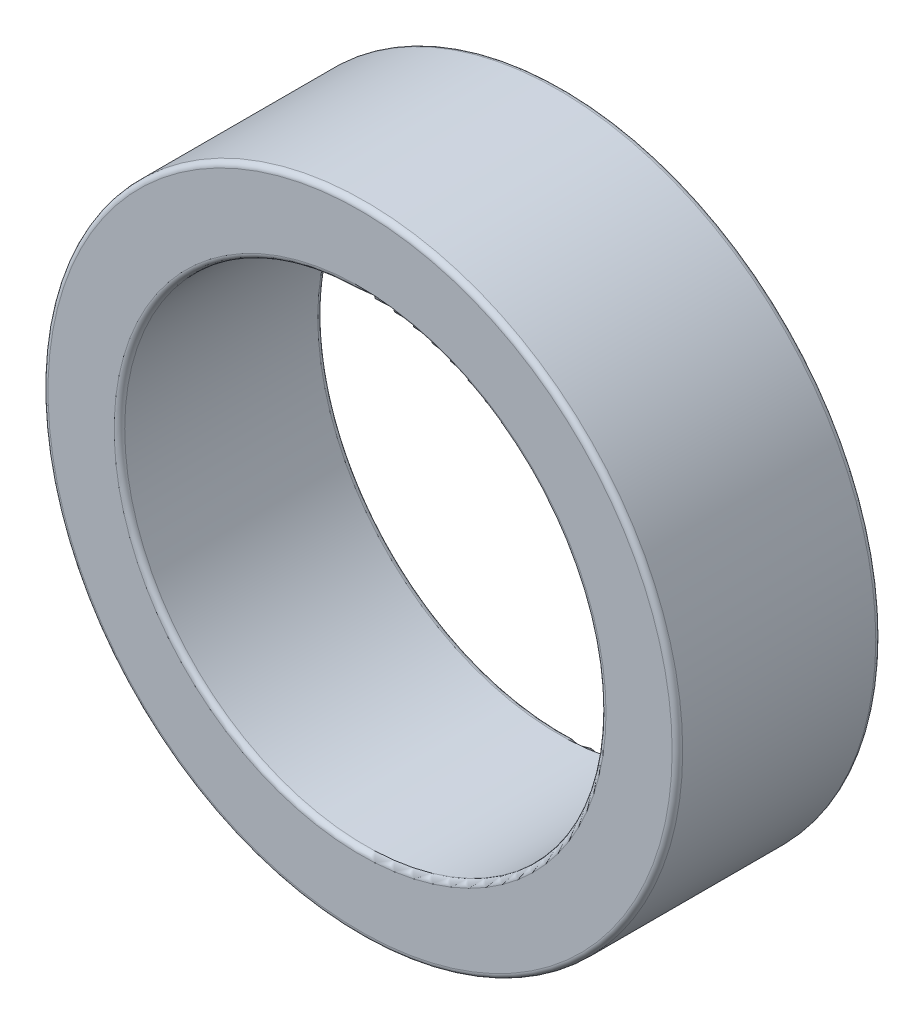
ISO-10303-21;
HEADER;
FILE_DESCRIPTION(('STEP AP214'),'2;1');
FILE_NAME('part.step','',(''),(''),'','','');
FILE_SCHEMA(('AUTOMOTIVE_DESIGN { 1 0 10303 214 1 1 1 1 }'));
ENDSEC;
DATA;
#1=APPLICATION_CONTEXT('core data for automotive mechanical design processes');
#2=APPLICATION_PROTOCOL_DEFINITION('international standard','automotive_design',2000,#1);
#3=PRODUCT_CONTEXT('',#1,'mechanical');
#4=PRODUCT('Part','Part','',(#3));
#5=PRODUCT_RELATED_PRODUCT_CATEGORY('part','',(#4));
#6=PRODUCT_DEFINITION_FORMATION('','',#4);
#7=PRODUCT_DEFINITION_CONTEXT('part definition',#1,'design');
#8=PRODUCT_DEFINITION('design','',#6,#7);
#9=PRODUCT_DEFINITION_SHAPE('','',#8);
#10=(LENGTH_UNIT() NAMED_UNIT(*) SI_UNIT(.MILLI.,.METRE.));
#11=(NAMED_UNIT(*) PLANE_ANGLE_UNIT() SI_UNIT($,.RADIAN.));
#12=(NAMED_UNIT(*) SI_UNIT($,.STERADIAN.) SOLID_ANGLE_UNIT());
#13=UNCERTAINTY_MEASURE_WITH_UNIT(LENGTH_MEASURE(1.E-05),#10,'distance_accuracy_value','');
#14=(GEOMETRIC_REPRESENTATION_CONTEXT(3) GLOBAL_UNCERTAINTY_ASSIGNED_CONTEXT((#13)) GLOBAL_UNIT_ASSIGNED_CONTEXT((#10,
#11,#12)) REPRESENTATION_CONTEXT('',''));
#15=CARTESIAN_POINT('',(0.,0.,0.));
#16=DIRECTION('',(0.,0.,1.));
#17=DIRECTION('',(1.,0.,0.));
#18=AXIS2_PLACEMENT_3D('',#15,#16,#17);
#19=CARTESIAN_POINT('',(0.,0.,3.85));
#20=DIRECTION('',(0.,0.,1.));
#21=DIRECTION('',(1.,0.,0.));
#22=AXIS2_PLACEMENT_3D('',#19,#20,#21);
#23=PLANE('',#22);
#24=CARTESIAN_POINT('',(0.,0.,3.85));
#25=DIRECTION('',(0.,0.,1.));
#26=DIRECTION('',(1.,0.,0.));
#27=AXIS2_PLACEMENT_3D('',#24,#25,#26);
#28=CIRCLE('',#27,4.65);
#29=CARTESIAN_POINT('',(4.65,0.,3.85));
#30=VERTEX_POINT('',#29);
#31=EDGE_CURVE('E10',#30,#30,#28,.F.);
#32=ORIENTED_EDGE('',*,*,#31,.T.);
#33=EDGE_LOOP('',(#32));
#34=FACE_BOUND('',#33,.T.);
#35=CARTESIAN_POINT('',(0.,0.,3.85));
#36=DIRECTION('',(0.,0.,1.));
#37=DIRECTION('',(1.,0.,0.));
#38=AXIS2_PLACEMENT_3D('',#35,#36,#37);
#39=CIRCLE('',#38,5.9);
#40=CARTESIAN_POINT('',(5.9,0.,3.85));
#41=VERTEX_POINT('',#40);
#42=EDGE_CURVE('E39',#41,#41,#39,.T.);
#43=ORIENTED_EDGE('',*,*,#42,.T.);
#44=EDGE_LOOP('',(#43));
#45=FACE_BOUND('',#44,.T.);
#46=ADVANCED_FACE('F32',(#34,#45),#23,.T.);
#47=CARTESIAN_POINT('',(0.,0.,0.));
#48=DIRECTION('',(0.,0.,1.));
#49=DIRECTION('',(1.,0.,0.));
#50=AXIS2_PLACEMENT_3D('',#47,#48,#49);
#51=PLANE('',#50);
#52=CARTESIAN_POINT('',(0.,0.,0.));
#53=DIRECTION('',(0.,0.,1.));
#54=DIRECTION('',(1.,0.,0.));
#55=AXIS2_PLACEMENT_3D('',#52,#53,#54);
#56=CIRCLE('',#55,4.65);
#57=CARTESIAN_POINT('',(4.65,0.,0.));
#58=VERTEX_POINT('',#57);
#59=EDGE_CURVE('E58',#58,#58,#56,.T.);
#60=ORIENTED_EDGE('',*,*,#59,.T.);
#61=EDGE_LOOP('',(#60));
#62=FACE_BOUND('',#61,.T.);
#63=CARTESIAN_POINT('',(0.,0.,0.));
#64=DIRECTION('',(0.,0.,1.));
#65=DIRECTION('',(1.,0.,0.));
#66=AXIS2_PLACEMENT_3D('',#63,#64,#65);
#67=CIRCLE('',#66,5.9);
#68=CARTESIAN_POINT('',(5.9,0.,0.));
#69=VERTEX_POINT('',#68);
#70=EDGE_CURVE('E61',#69,#69,#67,.F.);
#71=ORIENTED_EDGE('',*,*,#70,.T.);
#72=EDGE_LOOP('',(#71));
#73=FACE_BOUND('',#72,.T.);
#74=ADVANCED_FACE('F65',(#62,#73),#51,.F.);
#75=CARTESIAN_POINT('',(0.,0.,3.85));
#76=DIRECTION('',(0.,0.,-1.));
#77=DIRECTION('',(-1.,0.,0.));
#78=AXIS2_PLACEMENT_3D('',#75,#76,#77);
#79=CYLINDRICAL_SURFACE('',#78,6.);
#80=CARTESIAN_POINT('',(0.,0.,0.0999999999999998));
#81=DIRECTION('',(0.,0.,1.));
#82=DIRECTION('',(1.,0.,0.));
#83=AXIS2_PLACEMENT_3D('',#80,#81,#82);
#84=CIRCLE('',#83,6.);
#85=CARTESIAN_POINT('',(6.,0.,0.0999999999999998));
#86=VERTEX_POINT('',#85);
#87=EDGE_CURVE('E43',#86,#86,#84,.T.);
#88=ORIENTED_EDGE('',*,*,#87,.T.);
#89=EDGE_LOOP('',(#88));
#90=FACE_BOUND('',#89,.T.);
#91=CARTESIAN_POINT('',(0.,0.,3.75));
#92=DIRECTION('',(0.,0.,1.));
#93=DIRECTION('',(1.,0.,0.));
#94=AXIS2_PLACEMENT_3D('',#91,#92,#93);
#95=CIRCLE('',#94,6.);
#96=CARTESIAN_POINT('',(6.,0.,3.75));
#97=VERTEX_POINT('',#96);
#98=EDGE_CURVE('E47',#97,#97,#95,.F.);
#99=ORIENTED_EDGE('',*,*,#98,.T.);
#100=EDGE_LOOP('',(#99));
#101=FACE_BOUND('',#100,.T.);
#102=ADVANCED_FACE('F75',(#90,#101),#79,.T.);
#103=CARTESIAN_POINT('',(0.,0.,3.85));
#104=DIRECTION('',(0.,0.,-1.));
#105=DIRECTION('',(-1.,0.,0.));
#106=AXIS2_PLACEMENT_3D('',#103,#104,#105);
#107=CYLINDRICAL_SURFACE('',#106,4.55);
#108=CARTESIAN_POINT('',(0.,0.,0.0999999999999998));
#109=DIRECTION('',(0.,0.,1.));
#110=DIRECTION('',(1.,0.,0.));
#111=AXIS2_PLACEMENT_3D('',#108,#109,#110);
#112=CIRCLE('',#111,4.55);
#113=CARTESIAN_POINT('',(4.55,0.,0.0999999999999998));
#114=VERTEX_POINT('',#113);
#115=EDGE_CURVE('E52',#114,#114,#112,.F.);
#116=ORIENTED_EDGE('',*,*,#115,.T.);
#117=EDGE_LOOP('',(#116));
#118=FACE_BOUND('',#117,.T.);
#119=CARTESIAN_POINT('',(0.,0.,3.75));
#120=DIRECTION('',(0.,0.,1.));
#121=DIRECTION('',(1.,0.,0.));
#122=AXIS2_PLACEMENT_3D('',#119,#120,#121);
#123=CIRCLE('',#122,4.55);
#124=CARTESIAN_POINT('',(4.55,0.,3.75));
#125=VERTEX_POINT('',#124);
#126=EDGE_CURVE('E55',#125,#125,#123,.T.);
#127=ORIENTED_EDGE('',*,*,#126,.T.);
#128=EDGE_LOOP('',(#127));
#129=FACE_BOUND('',#128,.T.);
#130=ADVANCED_FACE('F78',(#118,#129),#107,.F.);
#131=CARTESIAN_POINT('',(0.,0.,0.0999999999999998));
#132=DIRECTION('',(0.,0.,1.));
#133=DIRECTION('',(1.,0.,0.));
#134=AXIS2_PLACEMENT_3D('',#131,#132,#133);
#135=TOROIDAL_SURFACE('',#134,4.65,0.1);
#136=ORIENTED_EDGE('',*,*,#115,.F.);
#137=EDGE_LOOP('',(#136));
#138=FACE_BOUND('',#137,.T.);
#139=ORIENTED_EDGE('',*,*,#59,.F.);
#140=EDGE_LOOP('',(#139));
#141=FACE_BOUND('',#140,.T.);
#142=ADVANCED_FACE('F71',(#138,#141),#135,.T.);
#143=CARTESIAN_POINT('',(0.,0.,0.0999999999999998));
#144=DIRECTION('',(0.,0.,1.));
#145=DIRECTION('',(1.,0.,0.));
#146=AXIS2_PLACEMENT_3D('',#143,#144,#145);
#147=TOROIDAL_SURFACE('',#146,5.9,0.1);
#148=ORIENTED_EDGE('',*,*,#70,.F.);
#149=EDGE_LOOP('',(#148));
#150=FACE_BOUND('',#149,.T.);
#151=ORIENTED_EDGE('',*,*,#87,.F.);
#152=EDGE_LOOP('',(#151));
#153=FACE_BOUND('',#152,.T.);
#154=ADVANCED_FACE('F67',(#150,#153),#147,.T.);
#155=CARTESIAN_POINT('',(0.,0.,3.75));
#156=DIRECTION('',(0.,0.,1.));
#157=DIRECTION('',(1.,0.,0.));
#158=AXIS2_PLACEMENT_3D('',#155,#156,#157);
#159=TOROIDAL_SURFACE('',#158,4.65,0.1);
#160=ORIENTED_EDGE('',*,*,#31,.F.);
#161=EDGE_LOOP('',(#160));
#162=FACE_BOUND('',#161,.T.);
#163=ORIENTED_EDGE('',*,*,#126,.F.);
#164=EDGE_LOOP('',(#163));
#165=FACE_BOUND('',#164,.T.);
#166=ADVANCED_FACE('F70',(#162,#165),#159,.T.);
#167=CARTESIAN_POINT('',(0.,0.,3.75));
#168=DIRECTION('',(0.,0.,1.));
#169=DIRECTION('',(1.,0.,0.));
#170=AXIS2_PLACEMENT_3D('',#167,#168,#169);
#171=TOROIDAL_SURFACE('',#170,5.9,0.1);
#172=ORIENTED_EDGE('',*,*,#98,.F.);
#173=EDGE_LOOP('',(#172));
#174=FACE_BOUND('',#173,.T.);
#175=ORIENTED_EDGE('',*,*,#42,.F.);
#176=EDGE_LOOP('',(#175));
#177=FACE_BOUND('',#176,.T.);
#178=ADVANCED_FACE('F34',(#174,#177),#171,.T.);
#179=CLOSED_SHELL('',(#46,#74,#102,#130,#142,#154,#166,#178));
#180=MANIFOLD_SOLID_BREP('B2',#179);
#181=ADVANCED_BREP_SHAPE_REPRESENTATION('',(#18,#180),#14);
#182=SHAPE_DEFINITION_REPRESENTATION(#9,#181);
ENDSEC;
END-ISO-10303-21;
